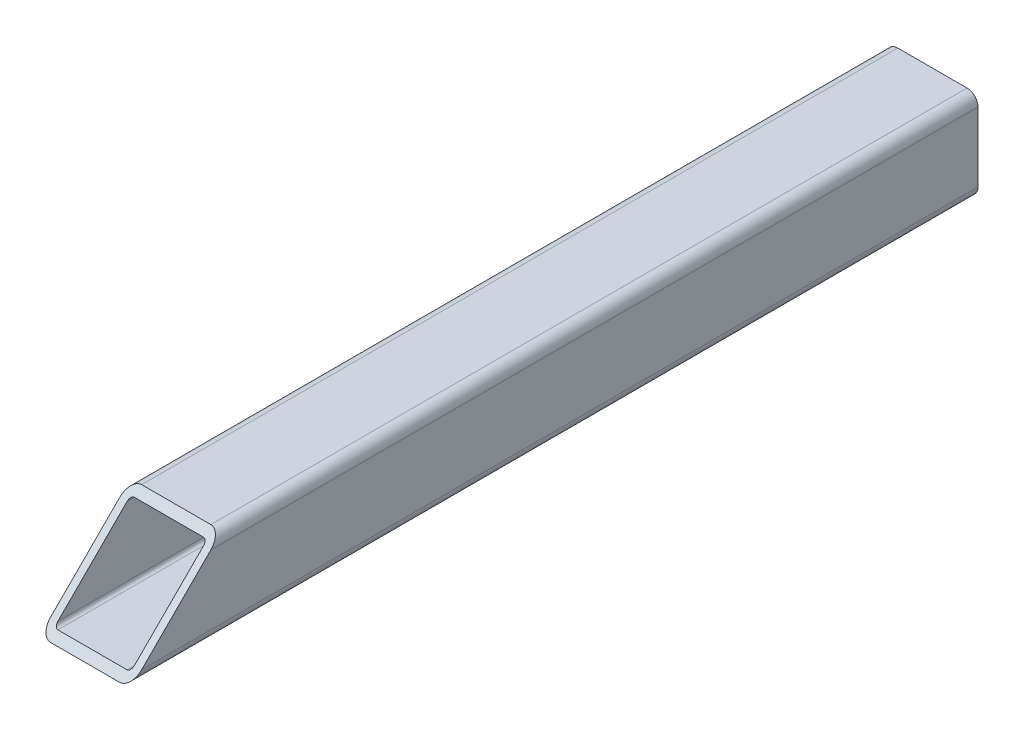
ISO-10303-21;
HEADER;
FILE_DESCRIPTION(('STEP AP214'),'2;1');
FILE_NAME('part.step','',(''),(''),'','','');
FILE_SCHEMA(('AUTOMOTIVE_DESIGN { 1 0 10303 214 1 1 1 1 }'));
ENDSEC;
DATA;
#1=APPLICATION_CONTEXT('core data for automotive mechanical design processes');
#2=APPLICATION_PROTOCOL_DEFINITION('international standard','automotive_design',2000,#1);
#3=PRODUCT_CONTEXT('',#1,'mechanical');
#4=PRODUCT('Part','Part','',(#3));
#5=PRODUCT_RELATED_PRODUCT_CATEGORY('part','',(#4));
#6=PRODUCT_DEFINITION_FORMATION('','',#4);
#7=PRODUCT_DEFINITION_CONTEXT('part definition',#1,'design');
#8=PRODUCT_DEFINITION('design','',#6,#7);
#9=PRODUCT_DEFINITION_SHAPE('','',#8);
#10=(LENGTH_UNIT() NAMED_UNIT(*) SI_UNIT(.MILLI.,.METRE.));
#11=(NAMED_UNIT(*) PLANE_ANGLE_UNIT() SI_UNIT($,.RADIAN.));
#12=(NAMED_UNIT(*) SI_UNIT($,.STERADIAN.) SOLID_ANGLE_UNIT());
#13=UNCERTAINTY_MEASURE_WITH_UNIT(LENGTH_MEASURE(1.E-05),#10,'distance_accuracy_value','');
#14=(GEOMETRIC_REPRESENTATION_CONTEXT(3) GLOBAL_UNCERTAINTY_ASSIGNED_CONTEXT((#13)) GLOBAL_UNIT_ASSIGNED_CONTEXT((#10,
#11,#12)) REPRESENTATION_CONTEXT('',''));
#15=CARTESIAN_POINT('',(0.,0.,0.));
#16=DIRECTION('',(0.,0.,1.));
#17=DIRECTION('',(1.,0.,0.));
#18=AXIS2_PLACEMENT_3D('',#15,#16,#17);
#19=CARTESIAN_POINT('',(0.,0.,0.));
#20=DIRECTION('',(0.,0.,1.));
#21=DIRECTION('',(1.,0.,0.));
#22=AXIS2_PLACEMENT_3D('',#19,#20,#21);
#23=PLANE('',#22);
#24=DIRECTION('',(0.,1.,0.));
#25=VECTOR('',#24,1.);
#26=CARTESIAN_POINT('',(-12.5,-4.75,0.));
#27=LINE('',#26,#25);
#28=CARTESIAN_POINT('',(-12.5,-9.5,0.));
#29=VERTEX_POINT('',#28);
#30=CARTESIAN_POINT('',(-12.5,9.5,0.));
#31=VERTEX_POINT('',#30);
#32=EDGE_CURVE('E260',#29,#31,#27,.T.);
#33=ORIENTED_EDGE('',*,*,#32,.T.);
#34=CARTESIAN_POINT('',(-9.5,9.5,0.));
#35=DIRECTION('',(0.,0.,-1.));
#36=DIRECTION('',(0.,-1.,0.));
#37=AXIS2_PLACEMENT_3D('',#34,#35,#36);
#38=CIRCLE('',#37,3.);
#39=CARTESIAN_POINT('',(-9.5,12.5,0.));
#40=VERTEX_POINT('',#39);
#41=EDGE_CURVE('E224',#31,#40,#38,.T.);
#42=ORIENTED_EDGE('',*,*,#41,.T.);
#43=DIRECTION('',(1.,0.,0.));
#44=VECTOR('',#43,1.);
#45=CARTESIAN_POINT('',(-4.75,12.5,0.));
#46=LINE('',#45,#44);
#47=CARTESIAN_POINT('',(9.5,12.5,0.));
#48=VERTEX_POINT('',#47);
#49=EDGE_CURVE('E223',#40,#48,#46,.T.);
#50=ORIENTED_EDGE('',*,*,#49,.T.);
#51=CARTESIAN_POINT('',(9.5,9.5,0.));
#52=DIRECTION('',(0.,0.,-1.));
#53=DIRECTION('',(-1.,0.,0.));
#54=AXIS2_PLACEMENT_3D('',#51,#52,#53);
#55=CIRCLE('',#54,3.);
#56=CARTESIAN_POINT('',(12.5,9.5,0.));
#57=VERTEX_POINT('',#56);
#58=EDGE_CURVE('E268',#48,#57,#55,.T.);
#59=ORIENTED_EDGE('',*,*,#58,.T.);
#60=DIRECTION('',(0.,-1.,0.));
#61=VECTOR('',#60,1.);
#62=CARTESIAN_POINT('',(12.5,4.75,0.));
#63=LINE('',#62,#61);
#64=CARTESIAN_POINT('',(12.5,-9.5,0.));
#65=VERTEX_POINT('',#64);
#66=EDGE_CURVE('E185',#57,#65,#63,.T.);
#67=ORIENTED_EDGE('',*,*,#66,.T.);
#68=CARTESIAN_POINT('',(9.5,-9.5,0.));
#69=DIRECTION('',(0.,0.,-1.));
#70=DIRECTION('',(0.,1.,0.));
#71=AXIS2_PLACEMENT_3D('',#68,#69,#70);
#72=CIRCLE('',#71,3.);
#73=CARTESIAN_POINT('',(9.5,-12.5,0.));
#74=VERTEX_POINT('',#73);
#75=EDGE_CURVE('E179',#65,#74,#72,.T.);
#76=ORIENTED_EDGE('',*,*,#75,.T.);
#77=DIRECTION('',(-1.,0.,0.));
#78=VECTOR('',#77,1.);
#79=CARTESIAN_POINT('',(4.75,-12.5,0.));
#80=LINE('',#79,#78);
#81=CARTESIAN_POINT('',(-9.5,-12.5,0.));
#82=VERTEX_POINT('',#81);
#83=EDGE_CURVE('E27',#74,#82,#80,.T.);
#84=ORIENTED_EDGE('',*,*,#83,.T.);
#85=CARTESIAN_POINT('',(-9.5,-9.5,0.));
#86=DIRECTION('',(0.,0.,-1.));
#87=DIRECTION('',(1.,0.,0.));
#88=AXIS2_PLACEMENT_3D('',#85,#86,#87);
#89=CIRCLE('',#88,3.);
#90=EDGE_CURVE('E11',#82,#29,#89,.T.);
#91=ORIENTED_EDGE('',*,*,#90,.T.);
#92=EDGE_LOOP('',(#33,#42,#50,#59,#67,#76,#84,#91));
#93=FACE_BOUND('',#92,.T.);
#94=DIRECTION('',(-1.,0.,0.));
#95=VECTOR('',#94,1.);
#96=CARTESIAN_POINT('',(-4.75,10.5,0.));
#97=LINE('',#96,#95);
#98=CARTESIAN_POINT('',(9.5,10.5,0.));
#99=VERTEX_POINT('',#98);
#100=CARTESIAN_POINT('',(-9.5,10.5,0.));
#101=VERTEX_POINT('',#100);
#102=EDGE_CURVE('E243',#99,#101,#97,.T.);
#103=ORIENTED_EDGE('',*,*,#102,.T.);
#104=CARTESIAN_POINT('',(-9.5,9.5,0.));
#105=DIRECTION('',(0.,0.,1.));
#106=DIRECTION('',(0.,-1.,0.));
#107=AXIS2_PLACEMENT_3D('',#104,#105,#106);
#108=CIRCLE('',#107,1.);
#109=CARTESIAN_POINT('',(-10.5,9.5,0.));
#110=VERTEX_POINT('',#109);
#111=EDGE_CURVE('E251',#101,#110,#108,.T.);
#112=ORIENTED_EDGE('',*,*,#111,.T.);
#113=DIRECTION('',(0.,-1.,0.));
#114=VECTOR('',#113,1.);
#115=CARTESIAN_POINT('',(-10.5,-4.75,0.));
#116=LINE('',#115,#114);
#117=CARTESIAN_POINT('',(-10.5,-9.5,0.));
#118=VERTEX_POINT('',#117);
#119=EDGE_CURVE('E151',#110,#118,#116,.T.);
#120=ORIENTED_EDGE('',*,*,#119,.T.);
#121=CARTESIAN_POINT('',(-9.5,-9.5,0.));
#122=DIRECTION('',(0.,0.,1.));
#123=DIRECTION('',(1.,0.,0.));
#124=AXIS2_PLACEMENT_3D('',#121,#122,#123);
#125=CIRCLE('',#124,1.);
#126=CARTESIAN_POINT('',(-9.5,-10.5,0.));
#127=VERTEX_POINT('',#126);
#128=EDGE_CURVE('E272',#118,#127,#125,.T.);
#129=ORIENTED_EDGE('',*,*,#128,.T.);
#130=DIRECTION('',(1.,0.,0.));
#131=VECTOR('',#130,1.);
#132=CARTESIAN_POINT('',(4.75,-10.5,0.));
#133=LINE('',#132,#131);
#134=CARTESIAN_POINT('',(9.5,-10.5,0.));
#135=VERTEX_POINT('',#134);
#136=EDGE_CURVE('E267',#127,#135,#133,.T.);
#137=ORIENTED_EDGE('',*,*,#136,.T.);
#138=CARTESIAN_POINT('',(9.5,-9.5,0.));
#139=DIRECTION('',(0.,0.,1.));
#140=DIRECTION('',(0.,1.,0.));
#141=AXIS2_PLACEMENT_3D('',#138,#139,#140);
#142=CIRCLE('',#141,1.);
#143=CARTESIAN_POINT('',(10.5,-9.5,0.));
#144=VERTEX_POINT('',#143);
#145=EDGE_CURVE('E276',#135,#144,#142,.T.);
#146=ORIENTED_EDGE('',*,*,#145,.T.);
#147=DIRECTION('',(0.,1.,0.));
#148=VECTOR('',#147,1.);
#149=CARTESIAN_POINT('',(10.5,4.75,0.));
#150=LINE('',#149,#148);
#151=CARTESIAN_POINT('',(10.5,9.5,0.));
#152=VERTEX_POINT('',#151);
#153=EDGE_CURVE('E226',#144,#152,#150,.T.);
#154=ORIENTED_EDGE('',*,*,#153,.T.);
#155=CARTESIAN_POINT('',(9.5,9.5,0.));
#156=DIRECTION('',(0.,0.,1.));
#157=DIRECTION('',(-1.,0.,0.));
#158=AXIS2_PLACEMENT_3D('',#155,#156,#157);
#159=CIRCLE('',#158,1.);
#160=EDGE_CURVE('E142',#152,#99,#159,.T.);
#161=ORIENTED_EDGE('',*,*,#160,.T.);
#162=EDGE_LOOP('',(#103,#112,#120,#129,#137,#146,#154,#161));
#163=FACE_BOUND('',#162,.T.);
#164=ADVANCED_FACE('F16',(#93,#163),#23,.F.);
#165=CARTESIAN_POINT('',(-9.5,-9.5,0.));
#166=DIRECTION('',(0.,0.,1.));
#167=DIRECTION('',(1.,0.,0.));
#168=AXIS2_PLACEMENT_3D('',#165,#166,#167);
#169=CYLINDRICAL_SURFACE('',#168,3.);
#170=CARTESIAN_POINT('',(-9.5,-9.5,229.49999998581));
#171=DIRECTION('',(0.,-0.707106781102225,-0.70710678127087));
#172=DIRECTION('',(0.,0.70710678127087,-0.707106781102225));
#173=AXIS2_PLACEMENT_3D('',#170,#171,#172);
#174=ELLIPSE('',#173,4.24264068661335,3.);
#175=CARTESIAN_POINT('',(-9.5,-12.5,232.50000009));
#176=VERTEX_POINT('',#175);
#177=CARTESIAN_POINT('',(-12.5,-9.5,229.49999998581));
#178=VERTEX_POINT('',#177);
#179=EDGE_CURVE('E281',#176,#178,#174,.T.);
#180=ORIENTED_EDGE('',*,*,#179,.T.);
#181=DIRECTION('',(0.,0.,1.));
#182=VECTOR('',#181,1.);
#183=CARTESIAN_POINT('',(-12.5,-9.5,0.));
#184=LINE('',#183,#182);
#185=EDGE_CURVE('E235',#29,#178,#184,.T.);
#186=ORIENTED_EDGE('',*,*,#185,.F.);
#187=ORIENTED_EDGE('',*,*,#90,.F.);
#188=DIRECTION('',(0.,0.,1.));
#189=VECTOR('',#188,1.);
#190=CARTESIAN_POINT('',(-9.5,-12.5,0.));
#191=LINE('',#190,#189);
#192=EDGE_CURVE('E218',#82,#176,#191,.T.);
#193=ORIENTED_EDGE('',*,*,#192,.T.);
#194=EDGE_LOOP('',(#180,#186,#187,#193));
#195=FACE_BOUND('',#194,.T.);
#196=ADVANCED_FACE('F385',(#195),#169,.T.);
#197=CARTESIAN_POINT('',(9.5,-12.5,0.));
#198=DIRECTION('',(0.,-1.,0.));
#199=DIRECTION('',(0.,0.,-1.));
#200=AXIS2_PLACEMENT_3D('',#197,#198,#199);
#201=PLANE('',#200);
#202=DIRECTION('',(-1.,0.,0.));
#203=VECTOR('',#202,1.);
#204=CARTESIAN_POINT('',(4.75,-12.5,232.50000009));
#205=LINE('',#204,#203);
#206=CARTESIAN_POINT('',(9.5,-12.5,232.50000009));
#207=VERTEX_POINT('',#206);
#208=EDGE_CURVE('E195',#207,#176,#205,.T.);
#209=ORIENTED_EDGE('',*,*,#208,.T.);
#210=ORIENTED_EDGE('',*,*,#192,.F.);
#211=ORIENTED_EDGE('',*,*,#83,.F.);
#212=DIRECTION('',(0.,0.,1.));
#213=VECTOR('',#212,1.);
#214=CARTESIAN_POINT('',(9.5,-12.5,0.));
#215=LINE('',#214,#213);
#216=EDGE_CURVE('E286',#74,#207,#215,.T.);
#217=ORIENTED_EDGE('',*,*,#216,.T.);
#218=EDGE_LOOP('',(#209,#210,#211,#217));
#219=FACE_BOUND('',#218,.T.);
#220=ADVANCED_FACE('F382',(#219),#201,.T.);
#221=CARTESIAN_POINT('',(9.5,-9.5,0.));
#222=DIRECTION('',(0.,0.,1.));
#223=DIRECTION('',(0.,1.,0.));
#224=AXIS2_PLACEMENT_3D('',#221,#222,#223);
#225=CYLINDRICAL_SURFACE('',#224,3.);
#226=CARTESIAN_POINT('',(9.5,-9.5,229.49999998581));
#227=DIRECTION('',(0.,-0.707106781102225,-0.70710678127087));
#228=DIRECTION('',(0.,0.70710678127087,-0.707106781102225));
#229=AXIS2_PLACEMENT_3D('',#226,#227,#228);
#230=ELLIPSE('',#229,4.24264068661335,3.);
#231=CARTESIAN_POINT('',(12.5,-9.5,229.49999998581));
#232=VERTEX_POINT('',#231);
#233=EDGE_CURVE('E176',#232,#207,#230,.T.);
#234=ORIENTED_EDGE('',*,*,#233,.T.);
#235=ORIENTED_EDGE('',*,*,#216,.F.);
#236=ORIENTED_EDGE('',*,*,#75,.F.);
#237=DIRECTION('',(0.,0.,1.));
#238=VECTOR('',#237,1.);
#239=CARTESIAN_POINT('',(12.5,-9.5,0.));
#240=LINE('',#239,#238);
#241=EDGE_CURVE('E172',#65,#232,#240,.T.);
#242=ORIENTED_EDGE('',*,*,#241,.T.);
#243=EDGE_LOOP('',(#234,#235,#236,#242));
#244=FACE_BOUND('',#243,.T.);
#245=ADVANCED_FACE('F174',(#244),#225,.T.);
#246=CARTESIAN_POINT('',(12.5,9.5,0.));
#247=DIRECTION('',(1.,0.,0.));
#248=DIRECTION('',(0.,1.,0.));
#249=AXIS2_PLACEMENT_3D('',#246,#247,#248);
#250=PLANE('',#249);
#251=DIRECTION('',(0.,-0.70710678127087,0.707106781102225));
#252=VECTOR('',#251,1.);
#253=CARTESIAN_POINT('',(12.5,112.374999994604,107.625000020273));
#254=LINE('',#253,#252);
#255=CARTESIAN_POINT('',(12.5,9.5,210.499999990341));
#256=VERTEX_POINT('',#255);
#257=EDGE_CURVE('E192',#256,#232,#254,.T.);
#258=ORIENTED_EDGE('',*,*,#257,.T.);
#259=ORIENTED_EDGE('',*,*,#241,.F.);
#260=ORIENTED_EDGE('',*,*,#66,.F.);
#261=DIRECTION('',(0.,0.,1.));
#262=VECTOR('',#261,1.);
#263=CARTESIAN_POINT('',(12.5,9.5,0.));
#264=LINE('',#263,#262);
#265=EDGE_CURVE('E201',#57,#256,#264,.T.);
#266=ORIENTED_EDGE('',*,*,#265,.T.);
#267=EDGE_LOOP('',(#258,#259,#260,#266));
#268=FACE_BOUND('',#267,.T.);
#269=ADVANCED_FACE('F199',(#268),#250,.T.);
#270=CARTESIAN_POINT('',(9.5,9.5,0.));
#271=DIRECTION('',(0.,0.,1.));
#272=DIRECTION('',(-1.,0.,0.));
#273=AXIS2_PLACEMENT_3D('',#270,#271,#272);
#274=CYLINDRICAL_SURFACE('',#273,1.);
#275=CARTESIAN_POINT('',(9.5,9.5,210.499999990341));
#276=DIRECTION('',(0.,0.707106781102225,0.70710678127087));
#277=DIRECTION('',(0.,-0.70710678127087,0.707106781102225));
#278=AXIS2_PLACEMENT_3D('',#275,#276,#277);
#279=ELLIPSE('',#278,1.41421356220445,1.);
#280=CARTESIAN_POINT('',(10.5,9.5,210.499999990341));
#281=VERTEX_POINT('',#280);
#282=CARTESIAN_POINT('',(9.5,10.5,209.49999999058));
#283=VERTEX_POINT('',#282);
#284=EDGE_CURVE('E236',#281,#283,#279,.T.);
#285=ORIENTED_EDGE('',*,*,#284,.T.);
#286=DIRECTION('',(0.,0.,1.));
#287=VECTOR('',#286,1.);
#288=CARTESIAN_POINT('',(9.5,10.5,0.));
#289=LINE('',#288,#287);
#290=EDGE_CURVE('E240',#99,#283,#289,.T.);
#291=ORIENTED_EDGE('',*,*,#290,.F.);
#292=ORIENTED_EDGE('',*,*,#160,.F.);
#293=DIRECTION('',(0.,0.,1.));
#294=VECTOR('',#293,1.);
#295=CARTESIAN_POINT('',(10.5,9.5,0.));
#296=LINE('',#295,#294);
#297=EDGE_CURVE('E229',#152,#281,#296,.T.);
#298=ORIENTED_EDGE('',*,*,#297,.T.);
#299=EDGE_LOOP('',(#285,#291,#292,#298));
#300=FACE_BOUND('',#299,.T.);
#301=ADVANCED_FACE('F525',(#300),#274,.F.);
#302=CARTESIAN_POINT('',(10.5,9.5,0.));
#303=DIRECTION('',(1.,0.,0.));
#304=DIRECTION('',(0.,-1.,0.));
#305=AXIS2_PLACEMENT_3D('',#302,#303,#304);
#306=PLANE('',#305);
#307=DIRECTION('',(0.,0.70710678127087,-0.707106781102225));
#308=VECTOR('',#307,1.);
#309=CARTESIAN_POINT('',(10.5,112.374999994604,107.625000020273));
#310=LINE('',#309,#308);
#311=CARTESIAN_POINT('',(10.5,-9.5,229.49999998581));
#312=VERTEX_POINT('',#311);
#313=EDGE_CURVE('E215',#312,#281,#310,.T.);
#314=ORIENTED_EDGE('',*,*,#313,.T.);
#315=ORIENTED_EDGE('',*,*,#297,.F.);
#316=ORIENTED_EDGE('',*,*,#153,.F.);
#317=DIRECTION('',(0.,0.,1.));
#318=VECTOR('',#317,1.);
#319=CARTESIAN_POINT('',(10.5,-9.5,0.));
#320=LINE('',#319,#318);
#321=EDGE_CURVE('E273',#144,#312,#320,.T.);
#322=ORIENTED_EDGE('',*,*,#321,.T.);
#323=EDGE_LOOP('',(#314,#315,#316,#322));
#324=FACE_BOUND('',#323,.T.);
#325=ADVANCED_FACE('F530',(#324),#306,.F.);
#326=CARTESIAN_POINT('',(9.5,-9.5,0.));
#327=DIRECTION('',(0.,0.,1.));
#328=DIRECTION('',(0.,1.,0.));
#329=AXIS2_PLACEMENT_3D('',#326,#327,#328);
#330=CYLINDRICAL_SURFACE('',#329,1.);
#331=CARTESIAN_POINT('',(9.5,-9.5,229.49999998581));
#332=DIRECTION('',(0.,0.707106781102225,0.70710678127087));
#333=DIRECTION('',(0.,0.70710678127087,-0.707106781102225));
#334=AXIS2_PLACEMENT_3D('',#331,#332,#333);
#335=ELLIPSE('',#334,1.41421356220445,1.);
#336=CARTESIAN_POINT('',(9.5,-10.5,230.499999985571));
#337=VERTEX_POINT('',#336);
#338=EDGE_CURVE('E205',#337,#312,#335,.T.);
#339=ORIENTED_EDGE('',*,*,#338,.T.);
#340=ORIENTED_EDGE('',*,*,#321,.F.);
#341=ORIENTED_EDGE('',*,*,#145,.F.);
#342=DIRECTION('',(0.,0.,1.));
#343=VECTOR('',#342,1.);
#344=CARTESIAN_POINT('',(9.5,-10.5,0.));
#345=LINE('',#344,#343);
#346=EDGE_CURVE('E264',#135,#337,#345,.T.);
#347=ORIENTED_EDGE('',*,*,#346,.T.);
#348=EDGE_LOOP('',(#339,#340,#341,#347));
#349=FACE_BOUND('',#348,.T.);
#350=ADVANCED_FACE('F331',(#349),#330,.F.);
#351=CARTESIAN_POINT('',(9.5,-10.5,0.));
#352=DIRECTION('',(0.,-1.,0.));
#353=DIRECTION('',(0.,0.,-1.));
#354=AXIS2_PLACEMENT_3D('',#351,#352,#353);
#355=PLANE('',#354);
#356=DIRECTION('',(1.,0.,0.));
#357=VECTOR('',#356,1.);
#358=CARTESIAN_POINT('',(4.75000000000006,-10.5,230.499999985571));
#359=LINE('',#358,#357);
#360=CARTESIAN_POINT('',(-9.5,-10.5,230.499999985571));
#361=VERTEX_POINT('',#360);
#362=EDGE_CURVE('E300',#361,#337,#359,.T.);
#363=ORIENTED_EDGE('',*,*,#362,.T.);
#364=ORIENTED_EDGE('',*,*,#346,.F.);
#365=ORIENTED_EDGE('',*,*,#136,.F.);
#366=DIRECTION('',(0.,0.,1.));
#367=VECTOR('',#366,1.);
#368=CARTESIAN_POINT('',(-9.5,-10.5,0.));
#369=LINE('',#368,#367);
#370=EDGE_CURVE('E269',#127,#361,#369,.T.);
#371=ORIENTED_EDGE('',*,*,#370,.T.);
#372=EDGE_LOOP('',(#363,#364,#365,#371));
#373=FACE_BOUND('',#372,.T.);
#374=ADVANCED_FACE('F18',(#373),#355,.F.);
#375=CARTESIAN_POINT('',(9.5,9.5,0.));
#376=DIRECTION('',(0.,0.,1.));
#377=DIRECTION('',(-1.,0.,0.));
#378=AXIS2_PLACEMENT_3D('',#375,#376,#377);
#379=CYLINDRICAL_SURFACE('',#378,3.);
#380=CARTESIAN_POINT('',(9.5,9.5,210.499999990341));
#381=DIRECTION('',(0.,-0.707106781102225,-0.70710678127087));
#382=DIRECTION('',(0.,-0.70710678127087,0.707106781102225));
#383=AXIS2_PLACEMENT_3D('',#380,#381,#382);
#384=ELLIPSE('',#383,4.24264068661335,3.);
#385=CARTESIAN_POINT('',(9.5,12.5,207.499999991057));
#386=VERTEX_POINT('',#385);
#387=EDGE_CURVE('E204',#386,#256,#384,.T.);
#388=ORIENTED_EDGE('',*,*,#387,.T.);
#389=ORIENTED_EDGE('',*,*,#265,.F.);
#390=ORIENTED_EDGE('',*,*,#58,.F.);
#391=DIRECTION('',(0.,0.,1.));
#392=VECTOR('',#391,1.);
#393=CARTESIAN_POINT('',(9.5,12.5,0.));
#394=LINE('',#393,#392);
#395=EDGE_CURVE('E221',#48,#386,#394,.T.);
#396=ORIENTED_EDGE('',*,*,#395,.T.);
#397=EDGE_LOOP('',(#388,#389,#390,#396));
#398=FACE_BOUND('',#397,.T.);
#399=ADVANCED_FACE('F501',(#398),#379,.T.);
#400=CARTESIAN_POINT('',(-9.5,12.5,0.));
#401=DIRECTION('',(0.,1.,0.));
#402=DIRECTION('',(1.,0.,0.));
#403=AXIS2_PLACEMENT_3D('',#400,#401,#402);
#404=PLANE('',#403);
#405=DIRECTION('',(1.,0.,0.));
#406=VECTOR('',#405,1.);
#407=CARTESIAN_POINT('',(-4.75,12.5,207.499999991057));
#408=LINE('',#407,#406);
#409=CARTESIAN_POINT('',(-9.5,12.5,207.499999991057));
#410=VERTEX_POINT('',#409);
#411=EDGE_CURVE('E212',#410,#386,#408,.T.);
#412=ORIENTED_EDGE('',*,*,#411,.T.);
#413=ORIENTED_EDGE('',*,*,#395,.F.);
#414=ORIENTED_EDGE('',*,*,#49,.F.);
#415=DIRECTION('',(0.,0.,1.));
#416=VECTOR('',#415,1.);
#417=CARTESIAN_POINT('',(-9.5,12.5,0.));
#418=LINE('',#417,#416);
#419=EDGE_CURVE('E232',#40,#410,#418,.T.);
#420=ORIENTED_EDGE('',*,*,#419,.T.);
#421=EDGE_LOOP('',(#412,#413,#414,#420));
#422=FACE_BOUND('',#421,.T.);
#423=ADVANCED_FACE('F495',(#422),#404,.T.);
#424=CARTESIAN_POINT('',(-9.5,9.5,0.));
#425=DIRECTION('',(0.,0.,1.));
#426=DIRECTION('',(0.,-1.,0.));
#427=AXIS2_PLACEMENT_3D('',#424,#425,#426);
#428=CYLINDRICAL_SURFACE('',#427,3.);
#429=CARTESIAN_POINT('',(-9.5,9.5,210.499999990341));
#430=DIRECTION('',(0.,-0.707106781102225,-0.70710678127087));
#431=DIRECTION('',(0.,-0.70710678127087,0.707106781102225));
#432=AXIS2_PLACEMENT_3D('',#429,#430,#431);
#433=ELLIPSE('',#432,4.24264068661335,3.);
#434=CARTESIAN_POINT('',(-12.5,9.5,210.499999990341));
#435=VERTEX_POINT('',#434);
#436=EDGE_CURVE('E282',#435,#410,#433,.T.);
#437=ORIENTED_EDGE('',*,*,#436,.T.);
#438=ORIENTED_EDGE('',*,*,#419,.F.);
#439=ORIENTED_EDGE('',*,*,#41,.F.);
#440=DIRECTION('',(0.,0.,1.));
#441=VECTOR('',#440,1.);
#442=CARTESIAN_POINT('',(-12.5,9.5,0.));
#443=LINE('',#442,#441);
#444=EDGE_CURVE('E20',#31,#435,#443,.T.);
#445=ORIENTED_EDGE('',*,*,#444,.T.);
#446=EDGE_LOOP('',(#437,#438,#439,#445));
#447=FACE_BOUND('',#446,.T.);
#448=ADVANCED_FACE('F500',(#447),#428,.T.);
#449=CARTESIAN_POINT('',(-12.5,-9.5,0.));
#450=DIRECTION('',(-1.,0.,0.));
#451=DIRECTION('',(0.,1.,0.));
#452=AXIS2_PLACEMENT_3D('',#449,#450,#451);
#453=PLANE('',#452);
#454=DIRECTION('',(0.,0.70710678127087,-0.707106781102225));
#455=VECTOR('',#454,1.);
#456=CARTESIAN_POINT('',(-12.5,107.624999993471,112.375000020273));
#457=LINE('',#456,#455);
#458=EDGE_CURVE('E277',#178,#435,#457,.T.);
#459=ORIENTED_EDGE('',*,*,#458,.T.);
#460=ORIENTED_EDGE('',*,*,#444,.F.);
#461=ORIENTED_EDGE('',*,*,#32,.F.);
#462=ORIENTED_EDGE('',*,*,#185,.T.);
#463=EDGE_LOOP('',(#459,#460,#461,#462));
#464=FACE_BOUND('',#463,.T.);
#465=ADVANCED_FACE('F569',(#464),#453,.T.);
#466=CARTESIAN_POINT('',(-9.5,-9.5,0.));
#467=DIRECTION('',(0.,0.,1.));
#468=DIRECTION('',(1.,0.,0.));
#469=AXIS2_PLACEMENT_3D('',#466,#467,#468);
#470=CYLINDRICAL_SURFACE('',#469,1.);
#471=CARTESIAN_POINT('',(-9.5,-9.5,229.49999998581));
#472=DIRECTION('',(0.,0.707106781102225,0.70710678127087));
#473=DIRECTION('',(0.,0.70710678127087,-0.707106781102225));
#474=AXIS2_PLACEMENT_3D('',#471,#472,#473);
#475=ELLIPSE('',#474,1.41421356220445,1.);
#476=CARTESIAN_POINT('',(-10.5,-9.5,229.49999998581));
#477=VERTEX_POINT('',#476);
#478=EDGE_CURVE('E304',#477,#361,#475,.T.);
#479=ORIENTED_EDGE('',*,*,#478,.T.);
#480=ORIENTED_EDGE('',*,*,#370,.F.);
#481=ORIENTED_EDGE('',*,*,#128,.F.);
#482=DIRECTION('',(0.,0.,1.));
#483=VECTOR('',#482,1.);
#484=CARTESIAN_POINT('',(-10.5,-9.5,0.));
#485=LINE('',#484,#483);
#486=EDGE_CURVE('E291',#118,#477,#485,.T.);
#487=ORIENTED_EDGE('',*,*,#486,.T.);
#488=EDGE_LOOP('',(#479,#480,#481,#487));
#489=FACE_BOUND('',#488,.T.);
#490=ADVANCED_FACE('F368',(#489),#470,.F.);
#491=CARTESIAN_POINT('',(-10.5,-9.5,0.));
#492=DIRECTION('',(-1.,0.,0.));
#493=DIRECTION('',(0.,0.,1.));
#494=AXIS2_PLACEMENT_3D('',#491,#492,#493);
#495=PLANE('',#494);
#496=DIRECTION('',(0.,-0.70710678127087,0.707106781102225));
#497=VECTOR('',#496,1.);
#498=CARTESIAN_POINT('',(-10.5,107.624999993471,112.375000020273));
#499=LINE('',#498,#497);
#500=CARTESIAN_POINT('',(-10.5,9.5,210.499999990341));
#501=VERTEX_POINT('',#500);
#502=EDGE_CURVE('E311',#501,#477,#499,.T.);
#503=ORIENTED_EDGE('',*,*,#502,.T.);
#504=ORIENTED_EDGE('',*,*,#486,.F.);
#505=ORIENTED_EDGE('',*,*,#119,.F.);
#506=DIRECTION('',(0.,0.,1.));
#507=VECTOR('',#506,1.);
#508=CARTESIAN_POINT('',(-10.5,9.5,0.));
#509=LINE('',#508,#507);
#510=EDGE_CURVE('E242',#110,#501,#509,.T.);
#511=ORIENTED_EDGE('',*,*,#510,.T.);
#512=EDGE_LOOP('',(#503,#504,#505,#511));
#513=FACE_BOUND('',#512,.T.);
#514=ADVANCED_FACE('F365',(#513),#495,.F.);
#515=CARTESIAN_POINT('',(-9.5,9.5,0.));
#516=DIRECTION('',(0.,0.,1.));
#517=DIRECTION('',(0.,-1.,0.));
#518=AXIS2_PLACEMENT_3D('',#515,#516,#517);
#519=CYLINDRICAL_SURFACE('',#518,1.);
#520=CARTESIAN_POINT('',(-9.5,9.5,210.499999990341));
#521=DIRECTION('',(0.,0.707106781102225,0.70710678127087));
#522=DIRECTION('',(0.,-0.70710678127087,0.707106781102225));
#523=AXIS2_PLACEMENT_3D('',#520,#521,#522);
#524=ELLIPSE('',#523,1.41421356220445,1.);
#525=CARTESIAN_POINT('',(-9.5,10.5,209.49999999058));
#526=VERTEX_POINT('',#525);
#527=EDGE_CURVE('E307',#526,#501,#524,.T.);
#528=ORIENTED_EDGE('',*,*,#527,.T.);
#529=ORIENTED_EDGE('',*,*,#510,.F.);
#530=ORIENTED_EDGE('',*,*,#111,.F.);
#531=DIRECTION('',(0.,0.,1.));
#532=VECTOR('',#531,1.);
#533=CARTESIAN_POINT('',(-9.5,10.5,0.));
#534=LINE('',#533,#532);
#535=EDGE_CURVE('E197',#101,#526,#534,.T.);
#536=ORIENTED_EDGE('',*,*,#535,.T.);
#537=EDGE_LOOP('',(#528,#529,#530,#536));
#538=FACE_BOUND('',#537,.T.);
#539=ADVANCED_FACE('F489',(#538),#519,.F.);
#540=CARTESIAN_POINT('',(-9.5,10.5,0.));
#541=DIRECTION('',(0.,1.,0.));
#542=DIRECTION('',(1.,0.,0.));
#543=AXIS2_PLACEMENT_3D('',#540,#541,#542);
#544=PLANE('',#543);
#545=DIRECTION('',(-1.,0.,0.));
#546=VECTOR('',#545,1.);
#547=CARTESIAN_POINT('',(-4.75,10.5,209.49999999058));
#548=LINE('',#547,#546);
#549=EDGE_CURVE('E239',#283,#526,#548,.T.);
#550=ORIENTED_EDGE('',*,*,#549,.T.);
#551=ORIENTED_EDGE('',*,*,#535,.F.);
#552=ORIENTED_EDGE('',*,*,#102,.F.);
#553=ORIENTED_EDGE('',*,*,#290,.T.);
#554=EDGE_LOOP('',(#550,#551,#552,#553));
#555=FACE_BOUND('',#554,.T.);
#556=ADVANCED_FACE('F541',(#555),#544,.F.);
#557=CARTESIAN_POINT('',(0.,109.999999994038,110.000000020273));
#558=DIRECTION('',(0.,-0.707106781102225,-0.70710678127087));
#559=DIRECTION('',(0.,-0.70710678127087,0.707106781102225));
#560=AXIS2_PLACEMENT_3D('',#557,#558,#559);
#561=PLANE('',#560);
#562=ORIENTED_EDGE('',*,*,#257,.F.);
#563=ORIENTED_EDGE('',*,*,#387,.F.);
#564=ORIENTED_EDGE('',*,*,#411,.F.);
#565=ORIENTED_EDGE('',*,*,#436,.F.);
#566=ORIENTED_EDGE('',*,*,#458,.F.);
#567=ORIENTED_EDGE('',*,*,#179,.F.);
#568=ORIENTED_EDGE('',*,*,#208,.F.);
#569=ORIENTED_EDGE('',*,*,#233,.F.);
#570=EDGE_LOOP('',(#562,#563,#564,#565,#566,#567,#568,#569));
#571=FACE_BOUND('',#570,.T.);
#572=ORIENTED_EDGE('',*,*,#362,.F.);
#573=ORIENTED_EDGE('',*,*,#478,.F.);
#574=ORIENTED_EDGE('',*,*,#502,.F.);
#575=ORIENTED_EDGE('',*,*,#527,.F.);
#576=ORIENTED_EDGE('',*,*,#549,.F.);
#577=ORIENTED_EDGE('',*,*,#284,.F.);
#578=ORIENTED_EDGE('',*,*,#313,.F.);
#579=ORIENTED_EDGE('',*,*,#338,.F.);
#580=EDGE_LOOP('',(#572,#573,#574,#575,#576,#577,#578,#579));
#581=FACE_BOUND('',#580,.T.);
#582=ADVANCED_FACE('F189',(#571,#581),#561,.F.);
#583=CLOSED_SHELL('',(#164,#196,#220,#245,#269,#301,#325,#350,#374,#399,#423,#448,#465,#490,
#514,#539,#556,#582));
#584=MANIFOLD_SOLID_BREP('B1',#583);
#585=ADVANCED_BREP_SHAPE_REPRESENTATION('',(#18,#584),#14);
#586=SHAPE_DEFINITION_REPRESENTATION(#9,#585);
ENDSEC;
END-ISO-10303-21;
